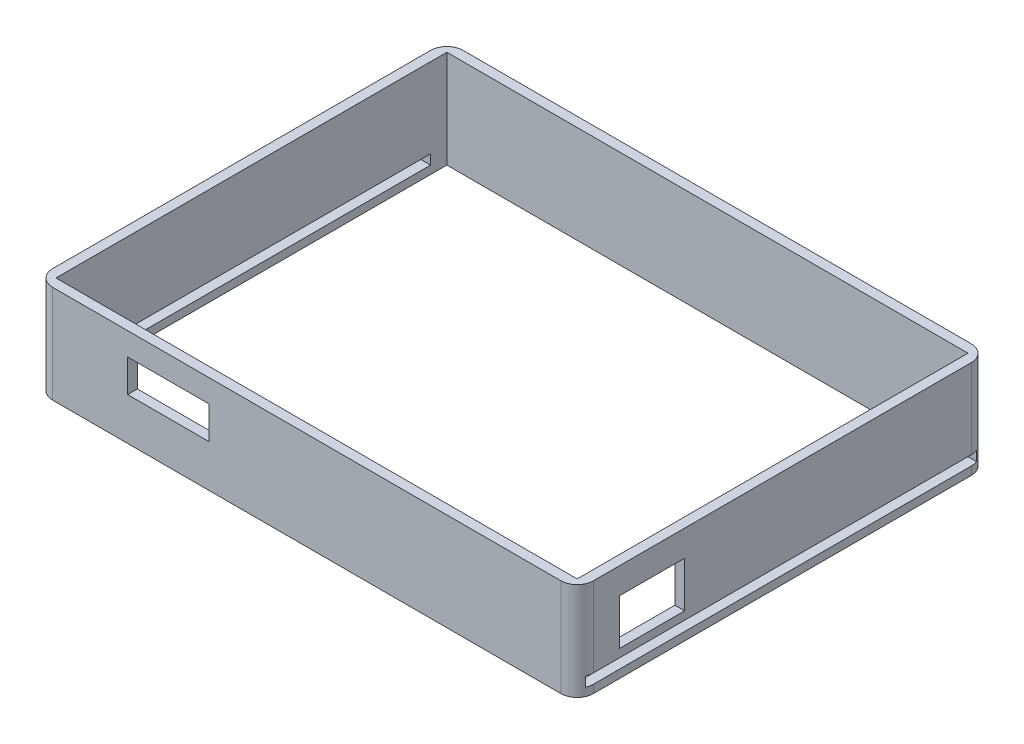
ISO-10303-21;
HEADER;
FILE_DESCRIPTION(('STEP AP214'),'2;1');
FILE_NAME('part.step','',(''),(''),'','','');
FILE_SCHEMA(('AUTOMOTIVE_DESIGN { 1 0 10303 214 1 1 1 1 }'));
ENDSEC;
DATA;
#1=APPLICATION_CONTEXT('core data for automotive mechanical design processes');
#2=APPLICATION_PROTOCOL_DEFINITION('international standard','automotive_design',2000,#1);
#3=PRODUCT_CONTEXT('',#1,'mechanical');
#4=PRODUCT('Part','Part','',(#3));
#5=PRODUCT_RELATED_PRODUCT_CATEGORY('part','',(#4));
#6=PRODUCT_DEFINITION_FORMATION('','',#4);
#7=PRODUCT_DEFINITION_CONTEXT('part definition',#1,'design');
#8=PRODUCT_DEFINITION('design','',#6,#7);
#9=PRODUCT_DEFINITION_SHAPE('','',#8);
#10=(LENGTH_UNIT() NAMED_UNIT(*) SI_UNIT(.MILLI.,.METRE.));
#11=(NAMED_UNIT(*) PLANE_ANGLE_UNIT() SI_UNIT($,.RADIAN.));
#12=(NAMED_UNIT(*) SI_UNIT($,.STERADIAN.) SOLID_ANGLE_UNIT());
#13=UNCERTAINTY_MEASURE_WITH_UNIT(LENGTH_MEASURE(1.E-05),#10,'distance_accuracy_value','');
#14=(GEOMETRIC_REPRESENTATION_CONTEXT(3) GLOBAL_UNCERTAINTY_ASSIGNED_CONTEXT((#13)) GLOBAL_UNIT_ASSIGNED_CONTEXT((#10,
#11,#12)) REPRESENTATION_CONTEXT('',''));
#15=CARTESIAN_POINT('',(0.,0.,0.));
#16=DIRECTION('',(0.,0.,1.));
#17=DIRECTION('',(1.,0.,0.));
#18=AXIS2_PLACEMENT_3D('',#15,#16,#17);
#19=CARTESIAN_POINT('',(82.9999999999999,30.,-63.));
#20=DIRECTION('',(-1.,0.,0.));
#21=DIRECTION('',(0.,0.,1.));
#22=AXIS2_PLACEMENT_3D('',#19,#20,#21);
#23=PLANE('',#22);
#24=DIRECTION('',(0.,1.,0.));
#25=VECTOR('',#24,1.);
#26=CARTESIAN_POINT('',(83.,30.,30.));
#27=LINE('',#26,#25);
#28=CARTESIAN_POINT('',(83.,7.99999999999999,30.));
#29=VERTEX_POINT('',#28);
#30=CARTESIAN_POINT('',(83.,22.,30.));
#31=VERTEX_POINT('',#30);
#32=EDGE_CURVE('E321',#29,#31,#27,.T.);
#33=ORIENTED_EDGE('',*,*,#32,.F.);
#34=DIRECTION('',(0.,0.,-1.));
#35=VECTOR('',#34,1.);
#36=CARTESIAN_POINT('',(82.9999999999999,8.,-63.));
#37=LINE('',#36,#35);
#38=CARTESIAN_POINT('',(83.,7.99999999999999,50.));
#39=VERTEX_POINT('',#38);
#40=EDGE_CURVE('E311',#39,#29,#37,.T.);
#41=ORIENTED_EDGE('',*,*,#40,.F.);
#42=DIRECTION('',(0.,-1.,0.));
#43=VECTOR('',#42,1.);
#44=CARTESIAN_POINT('',(83.,30.,50.));
#45=LINE('',#44,#43);
#46=CARTESIAN_POINT('',(83.,22.,50.));
#47=VERTEX_POINT('',#46);
#48=EDGE_CURVE('E314',#47,#39,#45,.T.);
#49=ORIENTED_EDGE('',*,*,#48,.F.);
#50=DIRECTION('',(0.,0.,1.));
#51=VECTOR('',#50,1.);
#52=CARTESIAN_POINT('',(82.9999999999999,22.,-63.));
#53=LINE('',#52,#51);
#54=EDGE_CURVE('E318',#31,#47,#53,.T.);
#55=ORIENTED_EDGE('',*,*,#54,.F.);
#56=EDGE_LOOP('',(#33,#41,#49,#55));
#57=FACE_BOUND('',#56,.T.);
#58=DIRECTION('',(0.,0.,1.));
#59=VECTOR('',#58,1.);
#60=CARTESIAN_POINT('',(82.9999999999999,5.5,-63.));
#61=LINE('',#60,#59);
#62=CARTESIAN_POINT('',(82.9999999999999,5.5,-58.));
#63=VERTEX_POINT('',#62);
#64=CARTESIAN_POINT('',(83.,5.5,58.));
#65=VERTEX_POINT('',#64);
#66=EDGE_CURVE('E285',#63,#65,#61,.T.);
#67=ORIENTED_EDGE('',*,*,#66,.F.);
#68=DIRECTION('',(0.,-1.,0.));
#69=VECTOR('',#68,1.);
#70=CARTESIAN_POINT('',(82.9999999999999,30.,-58.));
#71=LINE('',#70,#69);
#72=CARTESIAN_POINT('',(82.9999999999999,30.,-58.));
#73=VERTEX_POINT('',#72);
#74=EDGE_CURVE('E479',#63,#73,#71,.F.);
#75=ORIENTED_EDGE('',*,*,#74,.T.);
#76=DIRECTION('',(0.,0.,-1.));
#77=VECTOR('',#76,1.);
#78=CARTESIAN_POINT('',(82.9999999999999,30.,-63.));
#79=LINE('',#78,#77);
#80=CARTESIAN_POINT('',(83.,30.,58.));
#81=VERTEX_POINT('',#80);
#82=EDGE_CURVE('E398',#81,#73,#79,.T.);
#83=ORIENTED_EDGE('',*,*,#82,.F.);
#84=DIRECTION('',(0.,-1.,0.));
#85=VECTOR('',#84,1.);
#86=CARTESIAN_POINT('',(83.,30.,58.));
#87=LINE('',#86,#85);
#88=EDGE_CURVE('E475',#81,#65,#87,.T.);
#89=ORIENTED_EDGE('',*,*,#88,.T.);
#90=EDGE_LOOP('',(#67,#75,#83,#89));
#91=FACE_BOUND('',#90,.T.);
#92=ADVANCED_FACE('F38',(#57,#91),#23,.F.);
#93=DIRECTION('',(0.,0.,-1.));
#94=VECTOR('',#93,1.);
#95=CARTESIAN_POINT('',(82.9999999999999,2.5,-63.));
#96=LINE('',#95,#94);
#97=CARTESIAN_POINT('',(83.,2.5,58.));
#98=VERTEX_POINT('',#97);
#99=CARTESIAN_POINT('',(82.9999999999999,2.5,-58.));
#100=VERTEX_POINT('',#99);
#101=EDGE_CURVE('E274',#98,#100,#96,.T.);
#102=ORIENTED_EDGE('',*,*,#101,.F.);
#103=CARTESIAN_POINT('',(83.,0.,58.));
#104=VERTEX_POINT('',#103);
#105=EDGE_CURVE('E474',#98,#104,#87,.T.);
#106=ORIENTED_EDGE('',*,*,#105,.T.);
#107=DIRECTION('',(0.,0.,-1.));
#108=VECTOR('',#107,1.);
#109=CARTESIAN_POINT('',(82.9999999999999,0.,-63.));
#110=LINE('',#109,#108);
#111=CARTESIAN_POINT('',(82.9999999999999,0.,-58.));
#112=VERTEX_POINT('',#111);
#113=EDGE_CURVE('E397',#104,#112,#110,.T.);
#114=ORIENTED_EDGE('',*,*,#113,.T.);
#115=EDGE_CURVE('E480',#112,#100,#71,.F.);
#116=ORIENTED_EDGE('',*,*,#115,.T.);
#117=EDGE_LOOP('',(#102,#106,#114,#116));
#118=FACE_BOUND('',#117,.T.);
#119=ADVANCED_FACE('F566',(#118),#23,.F.);
#120=CARTESIAN_POINT('',(80.,30.,-60.));
#121=DIRECTION('',(-1.,0.,0.));
#122=DIRECTION('',(0.,0.,1.));
#123=AXIS2_PLACEMENT_3D('',#120,#121,#122);
#124=PLANE('',#123);
#125=DIRECTION('',(0.,0.,-1.));
#126=VECTOR('',#125,1.);
#127=CARTESIAN_POINT('',(80.,8.,-60.));
#128=LINE('',#127,#126);
#129=CARTESIAN_POINT('',(80.,7.99999999999999,50.));
#130=VERTEX_POINT('',#129);
#131=CARTESIAN_POINT('',(80.,8.,30.));
#132=VERTEX_POINT('',#131);
#133=EDGE_CURVE('E500',#130,#132,#128,.T.);
#134=ORIENTED_EDGE('',*,*,#133,.T.);
#135=DIRECTION('',(0.,1.,0.));
#136=VECTOR('',#135,1.);
#137=CARTESIAN_POINT('',(80.,30.,30.));
#138=LINE('',#137,#136);
#139=CARTESIAN_POINT('',(80.,22.,30.));
#140=VERTEX_POINT('',#139);
#141=EDGE_CURVE('E512',#132,#140,#138,.T.);
#142=ORIENTED_EDGE('',*,*,#141,.T.);
#143=DIRECTION('',(0.,0.,1.));
#144=VECTOR('',#143,1.);
#145=CARTESIAN_POINT('',(80.,22.,-60.));
#146=LINE('',#145,#144);
#147=CARTESIAN_POINT('',(80.,22.,50.));
#148=VERTEX_POINT('',#147);
#149=EDGE_CURVE('E508',#140,#148,#146,.T.);
#150=ORIENTED_EDGE('',*,*,#149,.T.);
#151=DIRECTION('',(0.,-1.,0.));
#152=VECTOR('',#151,1.);
#153=CARTESIAN_POINT('',(80.,30.,50.));
#154=LINE('',#153,#152);
#155=EDGE_CURVE('E504',#148,#130,#154,.T.);
#156=ORIENTED_EDGE('',*,*,#155,.T.);
#157=EDGE_LOOP('',(#134,#142,#150,#156));
#158=FACE_BOUND('',#157,.T.);
#159=DIRECTION('',(0.,-1.,0.));
#160=VECTOR('',#159,1.);
#161=CARTESIAN_POINT('',(80.,30.,-60.));
#162=LINE('',#161,#160);
#163=CARTESIAN_POINT('',(80.,30.,-60.));
#164=VERTEX_POINT('',#163);
#165=CARTESIAN_POINT('',(80.,5.5,-60.));
#166=VERTEX_POINT('',#165);
#167=EDGE_CURVE('E393',#164,#166,#162,.T.);
#168=ORIENTED_EDGE('',*,*,#167,.T.);
#169=DIRECTION('',(0.,0.,1.));
#170=VECTOR('',#169,1.);
#171=CARTESIAN_POINT('',(80.,5.5,-60.));
#172=LINE('',#171,#170);
#173=CARTESIAN_POINT('',(80.,5.5,60.));
#174=VERTEX_POINT('',#173);
#175=EDGE_CURVE('E292',#166,#174,#172,.T.);
#176=ORIENTED_EDGE('',*,*,#175,.T.);
#177=DIRECTION('',(0.,-1.,0.));
#178=VECTOR('',#177,1.);
#179=CARTESIAN_POINT('',(80.,30.,60.));
#180=LINE('',#179,#178);
#181=CARTESIAN_POINT('',(80.,30.,60.));
#182=VERTEX_POINT('',#181);
#183=EDGE_CURVE('E382',#182,#174,#180,.T.);
#184=ORIENTED_EDGE('',*,*,#183,.F.);
#185=DIRECTION('',(0.,0.,-1.));
#186=VECTOR('',#185,1.);
#187=CARTESIAN_POINT('',(80.,30.,-60.));
#188=LINE('',#187,#186);
#189=EDGE_CURVE('E353',#182,#164,#188,.T.);
#190=ORIENTED_EDGE('',*,*,#189,.T.);
#191=EDGE_LOOP('',(#168,#176,#184,#190));
#192=FACE_BOUND('',#191,.T.);
#193=ADVANCED_FACE('F572',(#158,#192),#124,.T.);
#194=CARTESIAN_POINT('',(80.,2.5,60.));
#195=VERTEX_POINT('',#194);
#196=CARTESIAN_POINT('',(80.,0.,60.));
#197=VERTEX_POINT('',#196);
#198=EDGE_CURVE('E367',#195,#197,#180,.T.);
#199=ORIENTED_EDGE('',*,*,#198,.F.);
#200=DIRECTION('',(0.,0.,-1.));
#201=VECTOR('',#200,1.);
#202=CARTESIAN_POINT('',(80.,2.5,-60.));
#203=LINE('',#202,#201);
#204=CARTESIAN_POINT('',(80.,2.5,-60.));
#205=VERTEX_POINT('',#204);
#206=EDGE_CURVE('E281',#195,#205,#203,.T.);
#207=ORIENTED_EDGE('',*,*,#206,.T.);
#208=CARTESIAN_POINT('',(80.,0.,-60.));
#209=VERTEX_POINT('',#208);
#210=EDGE_CURVE('E392',#205,#209,#162,.T.);
#211=ORIENTED_EDGE('',*,*,#210,.T.);
#212=DIRECTION('',(0.,0.,-1.));
#213=VECTOR('',#212,1.);
#214=CARTESIAN_POINT('',(80.,0.,-60.));
#215=LINE('',#214,#213);
#216=EDGE_CURVE('E352',#197,#209,#215,.T.);
#217=ORIENTED_EDGE('',*,*,#216,.F.);
#218=EDGE_LOOP('',(#199,#207,#211,#217));
#219=FACE_BOUND('',#218,.T.);
#220=ADVANCED_FACE('F590',(#219),#124,.T.);
#221=CARTESIAN_POINT('',(78.,30.,-58.));
#222=DIRECTION('',(0.,-1.,0.));
#223=DIRECTION('',(0.,0.,-1.));
#224=AXIS2_PLACEMENT_3D('',#221,#222,#223);
#225=CYLINDRICAL_SURFACE('',#224,5.);
#226=ORIENTED_EDGE('',*,*,#74,.F.);
#227=CARTESIAN_POINT('',(78.,5.5,-58.));
#228=DIRECTION('',(0.,-1.,0.));
#229=DIRECTION('',(0.,0.,-1.));
#230=AXIS2_PLACEMENT_3D('',#227,#228,#229);
#231=CIRCLE('',#230,5.);
#232=CARTESIAN_POINT('',(82.5825756949558,5.5,-60.));
#233=VERTEX_POINT('',#232);
#234=EDGE_CURVE('E288',#63,#233,#231,.F.);
#235=ORIENTED_EDGE('',*,*,#234,.T.);
#236=DIRECTION('',(0.,-1.,0.));
#237=VECTOR('',#236,1.);
#238=CARTESIAN_POINT('',(82.5825756949558,30.,-60.));
#239=LINE('',#238,#237);
#240=CARTESIAN_POINT('',(82.5825756949558,2.5,-60.));
#241=VERTEX_POINT('',#240);
#242=EDGE_CURVE('E528',#233,#241,#239,.T.);
#243=ORIENTED_EDGE('',*,*,#242,.T.);
#244=CARTESIAN_POINT('',(78.,2.5,-58.));
#245=DIRECTION('',(0.,1.,0.));
#246=DIRECTION('',(0.,0.,1.));
#247=AXIS2_PLACEMENT_3D('',#244,#245,#246);
#248=CIRCLE('',#247,5.);
#249=EDGE_CURVE('E277',#241,#100,#248,.F.);
#250=ORIENTED_EDGE('',*,*,#249,.T.);
#251=ORIENTED_EDGE('',*,*,#115,.F.);
#252=CARTESIAN_POINT('',(78.,0.,-58.));
#253=DIRECTION('',(0.,1.,0.));
#254=DIRECTION('',(0.,0.,1.));
#255=AXIS2_PLACEMENT_3D('',#252,#253,#254);
#256=CIRCLE('',#255,5.);
#257=CARTESIAN_POINT('',(78.,0.,-63.));
#258=VERTEX_POINT('',#257);
#259=EDGE_CURVE('E439',#258,#112,#256,.F.);
#260=ORIENTED_EDGE('',*,*,#259,.F.);
#261=DIRECTION('',(0.,-1.,0.));
#262=VECTOR('',#261,1.);
#263=CARTESIAN_POINT('',(78.,30.,-63.));
#264=LINE('',#263,#262);
#265=CARTESIAN_POINT('',(78.,30.,-63.));
#266=VERTEX_POINT('',#265);
#267=EDGE_CURVE('E448',#266,#258,#264,.T.);
#268=ORIENTED_EDGE('',*,*,#267,.F.);
#269=CARTESIAN_POINT('',(78.,30.,-58.));
#270=DIRECTION('',(0.,1.,0.));
#271=DIRECTION('',(0.,0.,1.));
#272=AXIS2_PLACEMENT_3D('',#269,#270,#271);
#273=CIRCLE('',#272,5.);
#274=EDGE_CURVE('E458',#73,#266,#273,.T.);
#275=ORIENTED_EDGE('',*,*,#274,.F.);
#276=EDGE_LOOP('',(#226,#235,#243,#250,#251,#260,#268,#275));
#277=FACE_BOUND('',#276,.T.);
#278=ADVANCED_FACE('F588',(#277),#225,.T.);
#279=CARTESIAN_POINT('',(78.,30.,58.));
#280=DIRECTION('',(0.,-1.,0.));
#281=DIRECTION('',(0.,0.,-1.));
#282=AXIS2_PLACEMENT_3D('',#279,#280,#281);
#283=CYLINDRICAL_SURFACE('',#282,5.);
#284=DIRECTION('',(0.,-1.,0.));
#285=VECTOR('',#284,1.);
#286=CARTESIAN_POINT('',(82.5825756949558,30.,60.));
#287=LINE('',#286,#285);
#288=CARTESIAN_POINT('',(82.5825756949558,2.5,60.));
#289=VERTEX_POINT('',#288);
#290=CARTESIAN_POINT('',(82.5825756949558,5.5,60.));
#291=VERTEX_POINT('',#290);
#292=EDGE_CURVE('E520',#289,#291,#287,.F.);
#293=ORIENTED_EDGE('',*,*,#292,.T.);
#294=CARTESIAN_POINT('',(78.,5.5,58.));
#295=DIRECTION('',(0.,-1.,0.));
#296=DIRECTION('',(0.,0.,-1.));
#297=AXIS2_PLACEMENT_3D('',#294,#295,#296);
#298=CIRCLE('',#297,5.);
#299=EDGE_CURVE('E524',#291,#65,#298,.F.);
#300=ORIENTED_EDGE('',*,*,#299,.T.);
#301=ORIENTED_EDGE('',*,*,#88,.F.);
#302=CARTESIAN_POINT('',(78.,30.,58.));
#303=DIRECTION('',(0.,1.,0.));
#304=DIRECTION('',(0.,0.,1.));
#305=AXIS2_PLACEMENT_3D('',#302,#303,#304);
#306=CIRCLE('',#305,5.);
#307=CARTESIAN_POINT('',(78.,30.,63.));
#308=VERTEX_POINT('',#307);
#309=EDGE_CURVE('E455',#308,#81,#306,.T.);
#310=ORIENTED_EDGE('',*,*,#309,.F.);
#311=DIRECTION('',(0.,-1.,0.));
#312=VECTOR('',#311,1.);
#313=CARTESIAN_POINT('',(78.,30.,63.));
#314=LINE('',#313,#312);
#315=CARTESIAN_POINT('',(78.,0.,63.));
#316=VERTEX_POINT('',#315);
#317=EDGE_CURVE('E467',#316,#308,#314,.F.);
#318=ORIENTED_EDGE('',*,*,#317,.F.);
#319=CARTESIAN_POINT('',(78.,0.,58.));
#320=DIRECTION('',(0.,1.,0.));
#321=DIRECTION('',(0.,0.,1.));
#322=AXIS2_PLACEMENT_3D('',#319,#320,#321);
#323=CIRCLE('',#322,5.);
#324=EDGE_CURVE('E436',#104,#316,#323,.F.);
#325=ORIENTED_EDGE('',*,*,#324,.F.);
#326=ORIENTED_EDGE('',*,*,#105,.F.);
#327=CARTESIAN_POINT('',(78.,2.5,58.));
#328=DIRECTION('',(0.,1.,0.));
#329=DIRECTION('',(0.,0.,1.));
#330=AXIS2_PLACEMENT_3D('',#327,#328,#329);
#331=CIRCLE('',#330,5.);
#332=EDGE_CURVE('E516',#98,#289,#331,.F.);
#333=ORIENTED_EDGE('',*,*,#332,.T.);
#334=EDGE_LOOP('',(#293,#300,#301,#310,#318,#325,#326,#333));
#335=FACE_BOUND('',#334,.T.);
#336=ADVANCED_FACE('F40',(#335),#283,.T.);
#337=CARTESIAN_POINT('',(-83.,30.,63.));
#338=DIRECTION('',(0.,0.,-1.));
#339=DIRECTION('',(-1.,0.,0.));
#340=AXIS2_PLACEMENT_3D('',#337,#338,#339);
#341=PLANE('',#340);
#342=DIRECTION('',(1.,0.,0.));
#343=VECTOR('',#342,1.);
#344=CARTESIAN_POINT('',(-83.,30.,63.));
#345=LINE('',#344,#343);
#346=CARTESIAN_POINT('',(-78.,30.,63.));
#347=VERTEX_POINT('',#346);
#348=EDGE_CURVE('E411',#347,#308,#345,.T.);
#349=ORIENTED_EDGE('',*,*,#348,.F.);
#350=DIRECTION('',(0.,-1.,0.));
#351=VECTOR('',#350,1.);
#352=CARTESIAN_POINT('',(-78.,30.,63.));
#353=LINE('',#352,#351);
#354=CARTESIAN_POINT('',(-78.,0.,63.));
#355=VERTEX_POINT('',#354);
#356=EDGE_CURVE('E470',#347,#355,#353,.T.);
#357=ORIENTED_EDGE('',*,*,#356,.T.);
#358=DIRECTION('',(1.,0.,0.));
#359=VECTOR('',#358,1.);
#360=CARTESIAN_POINT('',(-83.,0.,63.));
#361=LINE('',#360,#359);
#362=EDGE_CURVE('E403',#355,#316,#361,.T.);
#363=ORIENTED_EDGE('',*,*,#362,.T.);
#364=ORIENTED_EDGE('',*,*,#317,.T.);
#365=EDGE_LOOP('',(#349,#357,#363,#364));
#366=FACE_BOUND('',#365,.T.);
#367=DIRECTION('',(0.,-1.,0.));
#368=VECTOR('',#367,1.);
#369=CARTESIAN_POINT('',(-55.,30.,63.));
#370=LINE('',#369,#368);
#371=CARTESIAN_POINT('',(-55.,23.,63.));
#372=VERTEX_POINT('',#371);
#373=CARTESIAN_POINT('',(-55.,13.,63.));
#374=VERTEX_POINT('',#373);
#375=EDGE_CURVE('E349',#372,#374,#370,.T.);
#376=ORIENTED_EDGE('',*,*,#375,.F.);
#377=DIRECTION('',(-1.,0.,0.));
#378=VECTOR('',#377,1.);
#379=CARTESIAN_POINT('',(-83.,23.,63.));
#380=LINE('',#379,#378);
#381=CARTESIAN_POINT('',(-30.,23.,63.));
#382=VERTEX_POINT('',#381);
#383=EDGE_CURVE('E339',#382,#372,#380,.T.);
#384=ORIENTED_EDGE('',*,*,#383,.F.);
#385=DIRECTION('',(0.,1.,0.));
#386=VECTOR('',#385,1.);
#387=CARTESIAN_POINT('',(-30.,30.,63.));
#388=LINE('',#387,#386);
#389=CARTESIAN_POINT('',(-30.,13.,63.));
#390=VERTEX_POINT('',#389);
#391=EDGE_CURVE('E342',#390,#382,#388,.T.);
#392=ORIENTED_EDGE('',*,*,#391,.F.);
#393=DIRECTION('',(1.,0.,0.));
#394=VECTOR('',#393,1.);
#395=CARTESIAN_POINT('',(-83.,13.,63.));
#396=LINE('',#395,#394);
#397=EDGE_CURVE('E346',#374,#390,#396,.T.);
#398=ORIENTED_EDGE('',*,*,#397,.F.);
#399=EDGE_LOOP('',(#376,#384,#392,#398));
#400=FACE_BOUND('',#399,.T.);
#401=ADVANCED_FACE('F596',(#366,#400),#341,.F.);
#402=CARTESIAN_POINT('',(-80.,30.,60.));
#403=DIRECTION('',(0.,0.,-1.));
#404=DIRECTION('',(-1.,0.,0.));
#405=AXIS2_PLACEMENT_3D('',#402,#403,#404);
#406=PLANE('',#405);
#407=ORIENTED_EDGE('',*,*,#183,.T.);
#408=DIRECTION('',(-1.,0.,0.));
#409=VECTOR('',#408,1.);
#410=CARTESIAN_POINT('',(100.,5.5,60.));
#411=LINE('',#410,#409);
#412=EDGE_CURVE('E267',#291,#174,#411,.T.);
#413=ORIENTED_EDGE('',*,*,#412,.F.);
#414=ORIENTED_EDGE('',*,*,#292,.F.);
#415=DIRECTION('',(-1.,0.,0.));
#416=VECTOR('',#415,1.);
#417=CARTESIAN_POINT('',(100.,2.5,60.));
#418=LINE('',#417,#416);
#419=EDGE_CURVE('E259',#289,#195,#418,.T.);
#420=ORIENTED_EDGE('',*,*,#419,.T.);
#421=ORIENTED_EDGE('',*,*,#198,.T.);
#422=DIRECTION('',(1.,0.,0.));
#423=VECTOR('',#422,1.);
#424=CARTESIAN_POINT('',(-80.,0.,60.));
#425=LINE('',#424,#423);
#426=CARTESIAN_POINT('',(-80.,0.,60.));
#427=VERTEX_POINT('',#426);
#428=EDGE_CURVE('E357',#427,#197,#425,.T.);
#429=ORIENTED_EDGE('',*,*,#428,.F.);
#430=DIRECTION('',(0.,-1.,0.));
#431=VECTOR('',#430,1.);
#432=CARTESIAN_POINT('',(-80.,30.,60.));
#433=LINE('',#432,#431);
#434=CARTESIAN_POINT('',(-80.,30.,60.));
#435=VERTEX_POINT('',#434);
#436=EDGE_CURVE('E386',#435,#427,#433,.T.);
#437=ORIENTED_EDGE('',*,*,#436,.F.);
#438=DIRECTION('',(1.,0.,0.));
#439=VECTOR('',#438,1.);
#440=CARTESIAN_POINT('',(-80.,30.,60.));
#441=LINE('',#440,#439);
#442=EDGE_CURVE('E364',#435,#182,#441,.T.);
#443=ORIENTED_EDGE('',*,*,#442,.T.);
#444=EDGE_LOOP('',(#407,#413,#414,#420,#421,#429,#437,#443));
#445=FACE_BOUND('',#444,.T.);
#446=DIRECTION('',(-1.,0.,0.));
#447=VECTOR('',#446,1.);
#448=CARTESIAN_POINT('',(-80.,23.,60.));
#449=LINE('',#448,#447);
#450=CARTESIAN_POINT('',(-30.,23.,60.));
#451=VERTEX_POINT('',#450);
#452=CARTESIAN_POINT('',(-55.,23.,60.));
#453=VERTEX_POINT('',#452);
#454=EDGE_CURVE('E484',#451,#453,#449,.T.);
#455=ORIENTED_EDGE('',*,*,#454,.T.);
#456=DIRECTION('',(0.,-1.,0.));
#457=VECTOR('',#456,1.);
#458=CARTESIAN_POINT('',(-55.,30.,60.));
#459=LINE('',#458,#457);
#460=CARTESIAN_POINT('',(-55.,13.,60.));
#461=VERTEX_POINT('',#460);
#462=EDGE_CURVE('E496',#453,#461,#459,.T.);
#463=ORIENTED_EDGE('',*,*,#462,.T.);
#464=DIRECTION('',(1.,0.,0.));
#465=VECTOR('',#464,1.);
#466=CARTESIAN_POINT('',(-80.,13.,60.));
#467=LINE('',#466,#465);
#468=CARTESIAN_POINT('',(-30.,13.,60.));
#469=VERTEX_POINT('',#468);
#470=EDGE_CURVE('E492',#461,#469,#467,.T.);
#471=ORIENTED_EDGE('',*,*,#470,.T.);
#472=DIRECTION('',(0.,1.,0.));
#473=VECTOR('',#472,1.);
#474=CARTESIAN_POINT('',(-30.,30.,60.));
#475=LINE('',#474,#473);
#476=EDGE_CURVE('E488',#469,#451,#475,.T.);
#477=ORIENTED_EDGE('',*,*,#476,.T.);
#478=EDGE_LOOP('',(#455,#463,#471,#477));
#479=FACE_BOUND('',#478,.T.);
#480=ADVANCED_FACE('F613',(#445,#479),#406,.T.);
#481=CARTESIAN_POINT('',(0.,30.,0.));
#482=DIRECTION('',(0.,1.,0.));
#483=DIRECTION('',(0.,0.,1.));
#484=AXIS2_PLACEMENT_3D('',#481,#482,#483);
#485=PLANE('',#484);
#486=DIRECTION('',(-1.,0.,0.));
#487=VECTOR('',#486,1.);
#488=CARTESIAN_POINT('',(-83.0000000000001,30.,-62.9999999999999));
#489=LINE('',#488,#487);
#490=CARTESIAN_POINT('',(-78.0000000000001,30.,-62.9999999999999));
#491=VERTEX_POINT('',#490);
#492=EDGE_CURVE('E402',#266,#491,#489,.T.);
#493=ORIENTED_EDGE('',*,*,#492,.T.);
#494=CARTESIAN_POINT('',(-78.0000000000001,30.,-58.));
#495=DIRECTION('',(0.,1.,0.));
#496=DIRECTION('',(0.,0.,1.));
#497=AXIS2_PLACEMENT_3D('',#494,#495,#496);
#498=CIRCLE('',#497,5.);
#499=CARTESIAN_POINT('',(-83.0000000000001,30.,-58.));
#500=VERTEX_POINT('',#499);
#501=EDGE_CURVE('E464',#491,#500,#498,.T.);
#502=ORIENTED_EDGE('',*,*,#501,.T.);
#503=DIRECTION('',(0.,0.,1.));
#504=VECTOR('',#503,1.);
#505=CARTESIAN_POINT('',(-83.0000000000001,30.,-62.9999999999999));
#506=LINE('',#505,#504);
#507=CARTESIAN_POINT('',(-83.,30.,58.));
#508=VERTEX_POINT('',#507);
#509=EDGE_CURVE('E407',#500,#508,#506,.T.);
#510=ORIENTED_EDGE('',*,*,#509,.T.);
#511=CARTESIAN_POINT('',(-78.,30.,58.));
#512=DIRECTION('',(0.,1.,0.));
#513=DIRECTION('',(0.,0.,1.));
#514=AXIS2_PLACEMENT_3D('',#511,#512,#513);
#515=CIRCLE('',#514,5.);
#516=EDGE_CURVE('E461',#508,#347,#515,.T.);
#517=ORIENTED_EDGE('',*,*,#516,.T.);
#518=ORIENTED_EDGE('',*,*,#348,.T.);
#519=ORIENTED_EDGE('',*,*,#309,.T.);
#520=ORIENTED_EDGE('',*,*,#82,.T.);
#521=ORIENTED_EDGE('',*,*,#274,.T.);
#522=EDGE_LOOP('',(#493,#502,#510,#517,#518,#519,#520,#521));
#523=FACE_BOUND('',#522,.T.);
#524=DIRECTION('',(-1.,0.,0.));
#525=VECTOR('',#524,1.);
#526=CARTESIAN_POINT('',(-80.,30.,-60.));
#527=LINE('',#526,#525);
#528=CARTESIAN_POINT('',(-80.,30.,-60.));
#529=VERTEX_POINT('',#528);
#530=EDGE_CURVE('E356',#164,#529,#527,.T.);
#531=ORIENTED_EDGE('',*,*,#530,.F.);
#532=ORIENTED_EDGE('',*,*,#189,.F.);
#533=ORIENTED_EDGE('',*,*,#442,.F.);
#534=DIRECTION('',(0.,0.,1.));
#535=VECTOR('',#534,1.);
#536=CARTESIAN_POINT('',(-80.,30.,-60.));
#537=LINE('',#536,#535);
#538=EDGE_CURVE('E360',#529,#435,#537,.T.);
#539=ORIENTED_EDGE('',*,*,#538,.F.);
#540=EDGE_LOOP('',(#531,#532,#533,#539));
#541=FACE_BOUND('',#540,.T.);
#542=ADVANCED_FACE('F631',(#523,#541),#485,.T.);
#543=CARTESIAN_POINT('',(0.,0.,0.));
#544=DIRECTION('',(0.,1.,0.));
#545=DIRECTION('',(0.,0.,1.));
#546=AXIS2_PLACEMENT_3D('',#543,#544,#545);
#547=PLANE('',#546);
#548=DIRECTION('',(0.,0.,1.));
#549=VECTOR('',#548,1.);
#550=CARTESIAN_POINT('',(-83.0000000000001,0.,-62.9999999999999));
#551=LINE('',#550,#549);
#552=CARTESIAN_POINT('',(-83.0000000000001,0.,-58.));
#553=VERTEX_POINT('',#552);
#554=CARTESIAN_POINT('',(-83.,0.,58.));
#555=VERTEX_POINT('',#554);
#556=EDGE_CURVE('E423',#553,#555,#551,.T.);
#557=ORIENTED_EDGE('',*,*,#556,.F.);
#558=CARTESIAN_POINT('',(-78.0000000000001,0.,-58.));
#559=DIRECTION('',(0.,1.,0.));
#560=DIRECTION('',(0.,0.,1.));
#561=AXIS2_PLACEMENT_3D('',#558,#559,#560);
#562=CIRCLE('',#561,5.);
#563=CARTESIAN_POINT('',(-78.0000000000001,0.,-62.9999999999999));
#564=VERTEX_POINT('',#563);
#565=EDGE_CURVE('E445',#553,#564,#562,.F.);
#566=ORIENTED_EDGE('',*,*,#565,.T.);
#567=DIRECTION('',(-1.,0.,0.));
#568=VECTOR('',#567,1.);
#569=CARTESIAN_POINT('',(-83.0000000000001,0.,-62.9999999999999));
#570=LINE('',#569,#568);
#571=EDGE_CURVE('E419',#258,#564,#570,.T.);
#572=ORIENTED_EDGE('',*,*,#571,.F.);
#573=ORIENTED_EDGE('',*,*,#259,.T.);
#574=ORIENTED_EDGE('',*,*,#113,.F.);
#575=ORIENTED_EDGE('',*,*,#324,.T.);
#576=ORIENTED_EDGE('',*,*,#362,.F.);
#577=CARTESIAN_POINT('',(-78.,0.,58.));
#578=DIRECTION('',(0.,1.,0.));
#579=DIRECTION('',(0.,0.,1.));
#580=AXIS2_PLACEMENT_3D('',#577,#578,#579);
#581=CIRCLE('',#580,5.);
#582=EDGE_CURVE('E442',#355,#555,#581,.F.);
#583=ORIENTED_EDGE('',*,*,#582,.T.);
#584=EDGE_LOOP('',(#557,#566,#572,#573,#574,#575,#576,#583));
#585=FACE_BOUND('',#584,.T.);
#586=ORIENTED_EDGE('',*,*,#216,.T.);
#587=DIRECTION('',(-1.,0.,0.));
#588=VECTOR('',#587,1.);
#589=CARTESIAN_POINT('',(-80.,0.,-60.));
#590=LINE('',#589,#588);
#591=CARTESIAN_POINT('',(-80.,0.,-60.));
#592=VERTEX_POINT('',#591);
#593=EDGE_CURVE('E371',#209,#592,#590,.T.);
#594=ORIENTED_EDGE('',*,*,#593,.T.);
#595=DIRECTION('',(0.,0.,1.));
#596=VECTOR('',#595,1.);
#597=CARTESIAN_POINT('',(-80.,0.,-60.));
#598=LINE('',#597,#596);
#599=EDGE_CURVE('E375',#592,#427,#598,.T.);
#600=ORIENTED_EDGE('',*,*,#599,.T.);
#601=ORIENTED_EDGE('',*,*,#428,.T.);
#602=EDGE_LOOP('',(#586,#594,#600,#601));
#603=FACE_BOUND('',#602,.T.);
#604=ADVANCED_FACE('F619',(#585,#603),#547,.F.);
#605=CARTESIAN_POINT('',(-83.0000000000001,30.,-62.9999999999999));
#606=DIRECTION('',(0.,0.,1.));
#607=DIRECTION('',(1.,0.,0.));
#608=AXIS2_PLACEMENT_3D('',#605,#606,#607);
#609=PLANE('',#608);
#610=ORIENTED_EDGE('',*,*,#571,.T.);
#611=DIRECTION('',(0.,-1.,0.));
#612=VECTOR('',#611,1.);
#613=CARTESIAN_POINT('',(-78.0000000000001,30.,-62.9999999999999));
#614=LINE('',#613,#612);
#615=EDGE_CURVE('E452',#564,#491,#614,.F.);
#616=ORIENTED_EDGE('',*,*,#615,.T.);
#617=ORIENTED_EDGE('',*,*,#492,.F.);
#618=ORIENTED_EDGE('',*,*,#267,.T.);
#619=EDGE_LOOP('',(#610,#616,#617,#618));
#620=FACE_BOUND('',#619,.T.);
#621=ADVANCED_FACE('F578',(#620),#609,.F.);
#622=CARTESIAN_POINT('',(-83.0000000000001,30.,-62.9999999999999));
#623=DIRECTION('',(1.,0.,0.));
#624=DIRECTION('',(0.,0.,-1.));
#625=AXIS2_PLACEMENT_3D('',#622,#623,#624);
#626=PLANE('',#625);
#627=DIRECTION('',(0.,0.,-1.));
#628=VECTOR('',#627,1.);
#629=CARTESIAN_POINT('',(-83.0000000000001,2.5,-62.9999999999999));
#630=LINE('',#629,#628);
#631=CARTESIAN_POINT('',(-83.,2.5,55.));
#632=VERTEX_POINT('',#631);
#633=CARTESIAN_POINT('',(-83.,2.5,-55.));
#634=VERTEX_POINT('',#633);
#635=EDGE_CURVE('E253',#632,#634,#630,.T.);
#636=ORIENTED_EDGE('',*,*,#635,.T.);
#637=DIRECTION('',(0.,1.,0.));
#638=VECTOR('',#637,1.);
#639=CARTESIAN_POINT('',(-83.0000000000001,30.,-55.));
#640=LINE('',#639,#638);
#641=CARTESIAN_POINT('',(-83.,5.5,-55.));
#642=VERTEX_POINT('',#641);
#643=EDGE_CURVE('E244',#634,#642,#640,.T.);
#644=ORIENTED_EDGE('',*,*,#643,.T.);
#645=DIRECTION('',(0.,0.,1.));
#646=VECTOR('',#645,1.);
#647=CARTESIAN_POINT('',(-83.0000000000001,5.5,-62.9999999999999));
#648=LINE('',#647,#646);
#649=CARTESIAN_POINT('',(-83.,5.5,55.));
#650=VERTEX_POINT('',#649);
#651=EDGE_CURVE('E232',#642,#650,#648,.T.);
#652=ORIENTED_EDGE('',*,*,#651,.T.);
#653=DIRECTION('',(0.,-1.,0.));
#654=VECTOR('',#653,1.);
#655=CARTESIAN_POINT('',(-83.,30.,55.));
#656=LINE('',#655,#654);
#657=EDGE_CURVE('E238',#650,#632,#656,.T.);
#658=ORIENTED_EDGE('',*,*,#657,.T.);
#659=EDGE_LOOP('',(#636,#644,#652,#658));
#660=FACE_BOUND('',#659,.T.);
#661=ORIENTED_EDGE('',*,*,#509,.F.);
#662=DIRECTION('',(0.,-1.,0.));
#663=VECTOR('',#662,1.);
#664=CARTESIAN_POINT('',(-83.0000000000001,30.,-58.));
#665=LINE('',#664,#663);
#666=EDGE_CURVE('E432',#500,#553,#665,.T.);
#667=ORIENTED_EDGE('',*,*,#666,.T.);
#668=ORIENTED_EDGE('',*,*,#556,.T.);
#669=DIRECTION('',(0.,-1.,0.));
#670=VECTOR('',#669,1.);
#671=CARTESIAN_POINT('',(-83.,30.,58.));
#672=LINE('',#671,#670);
#673=EDGE_CURVE('E415',#555,#508,#672,.F.);
#674=ORIENTED_EDGE('',*,*,#673,.T.);
#675=EDGE_LOOP('',(#661,#667,#668,#674));
#676=FACE_BOUND('',#675,.T.);
#677=ADVANCED_FACE('F251',(#660,#676),#626,.F.);
#678=CARTESIAN_POINT('',(-80.,30.,-60.));
#679=DIRECTION('',(0.,0.,1.));
#680=DIRECTION('',(1.,0.,0.));
#681=AXIS2_PLACEMENT_3D('',#678,#679,#680);
#682=PLANE('',#681);
#683=ORIENTED_EDGE('',*,*,#210,.F.);
#684=DIRECTION('',(-1.,0.,0.));
#685=VECTOR('',#684,1.);
#686=CARTESIAN_POINT('',(100.,2.5,-60.));
#687=LINE('',#686,#685);
#688=EDGE_CURVE('E255',#241,#205,#687,.T.);
#689=ORIENTED_EDGE('',*,*,#688,.F.);
#690=ORIENTED_EDGE('',*,*,#242,.F.);
#691=DIRECTION('',(-1.,0.,0.));
#692=VECTOR('',#691,1.);
#693=CARTESIAN_POINT('',(100.,5.5,-60.));
#694=LINE('',#693,#692);
#695=EDGE_CURVE('E270',#233,#166,#694,.T.);
#696=ORIENTED_EDGE('',*,*,#695,.T.);
#697=ORIENTED_EDGE('',*,*,#167,.F.);
#698=ORIENTED_EDGE('',*,*,#530,.T.);
#699=DIRECTION('',(0.,-1.,0.));
#700=VECTOR('',#699,1.);
#701=CARTESIAN_POINT('',(-80.,30.,-60.));
#702=LINE('',#701,#700);
#703=EDGE_CURVE('E389',#529,#592,#702,.T.);
#704=ORIENTED_EDGE('',*,*,#703,.T.);
#705=ORIENTED_EDGE('',*,*,#593,.F.);
#706=EDGE_LOOP('',(#683,#689,#690,#696,#697,#698,#704,#705));
#707=FACE_BOUND('',#706,.T.);
#708=ADVANCED_FACE('F633',(#707),#682,.T.);
#709=CARTESIAN_POINT('',(-80.,30.,-60.));
#710=DIRECTION('',(1.,0.,0.));
#711=DIRECTION('',(0.,0.,-1.));
#712=AXIS2_PLACEMENT_3D('',#709,#710,#711);
#713=PLANE('',#712);
#714=DIRECTION('',(0.,1.,0.));
#715=VECTOR('',#714,1.);
#716=CARTESIAN_POINT('',(-80.,30.,-55.));
#717=LINE('',#716,#715);
#718=CARTESIAN_POINT('',(-80.,2.5,-55.));
#719=VERTEX_POINT('',#718);
#720=CARTESIAN_POINT('',(-80.,5.5,-55.));
#721=VERTEX_POINT('',#720);
#722=EDGE_CURVE('E11',#719,#721,#717,.T.);
#723=ORIENTED_EDGE('',*,*,#722,.F.);
#724=DIRECTION('',(0.,0.,-1.));
#725=VECTOR('',#724,1.);
#726=CARTESIAN_POINT('',(-80.,2.5,-60.));
#727=LINE('',#726,#725);
#728=CARTESIAN_POINT('',(-80.,2.5,55.));
#729=VERTEX_POINT('',#728);
#730=EDGE_CURVE('E47',#729,#719,#727,.T.);
#731=ORIENTED_EDGE('',*,*,#730,.F.);
#732=DIRECTION('',(0.,-1.,0.));
#733=VECTOR('',#732,1.);
#734=CARTESIAN_POINT('',(-80.,30.,55.));
#735=LINE('',#734,#733);
#736=CARTESIAN_POINT('',(-80.,5.5,55.));
#737=VERTEX_POINT('',#736);
#738=EDGE_CURVE('E535',#737,#729,#735,.T.);
#739=ORIENTED_EDGE('',*,*,#738,.F.);
#740=DIRECTION('',(0.,0.,1.));
#741=VECTOR('',#740,1.);
#742=CARTESIAN_POINT('',(-80.,5.5,-60.));
#743=LINE('',#742,#741);
#744=EDGE_CURVE('E532',#721,#737,#743,.T.);
#745=ORIENTED_EDGE('',*,*,#744,.F.);
#746=EDGE_LOOP('',(#723,#731,#739,#745));
#747=FACE_BOUND('',#746,.T.);
#748=ORIENTED_EDGE('',*,*,#599,.F.);
#749=ORIENTED_EDGE('',*,*,#703,.F.);
#750=ORIENTED_EDGE('',*,*,#538,.T.);
#751=ORIENTED_EDGE('',*,*,#436,.T.);
#752=EDGE_LOOP('',(#748,#749,#750,#751));
#753=FACE_BOUND('',#752,.T.);
#754=ADVANCED_FACE('F548',(#747,#753),#713,.T.);
#755=CARTESIAN_POINT('',(-78.0000000000001,30.,-58.));
#756=DIRECTION('',(0.,-1.,0.));
#757=DIRECTION('',(0.,0.,-1.));
#758=AXIS2_PLACEMENT_3D('',#755,#756,#757);
#759=CYLINDRICAL_SURFACE('',#758,5.);
#760=ORIENTED_EDGE('',*,*,#501,.F.);
#761=ORIENTED_EDGE('',*,*,#615,.F.);
#762=ORIENTED_EDGE('',*,*,#565,.F.);
#763=ORIENTED_EDGE('',*,*,#666,.F.);
#764=EDGE_LOOP('',(#760,#761,#762,#763));
#765=FACE_BOUND('',#764,.T.);
#766=ADVANCED_FACE('F580',(#765),#759,.T.);
#767=CARTESIAN_POINT('',(-78.,30.,58.));
#768=DIRECTION('',(0.,-1.,0.));
#769=DIRECTION('',(0.,0.,-1.));
#770=AXIS2_PLACEMENT_3D('',#767,#768,#769);
#771=CYLINDRICAL_SURFACE('',#770,5.);
#772=ORIENTED_EDGE('',*,*,#516,.F.);
#773=ORIENTED_EDGE('',*,*,#673,.F.);
#774=ORIENTED_EDGE('',*,*,#582,.F.);
#775=ORIENTED_EDGE('',*,*,#356,.F.);
#776=EDGE_LOOP('',(#772,#773,#774,#775));
#777=FACE_BOUND('',#776,.T.);
#778=ADVANCED_FACE('F583',(#777),#771,.T.);
#779=CARTESIAN_POINT('',(-55.,23.,100.));
#780=DIRECTION('',(1.,0.,0.));
#781=DIRECTION('',(0.,0.,-1.));
#782=AXIS2_PLACEMENT_3D('',#779,#780,#781);
#783=PLANE('',#782);
#784=ORIENTED_EDGE('',*,*,#375,.T.);
#785=DIRECTION('',(0.,0.,-1.));
#786=VECTOR('',#785,1.);
#787=CARTESIAN_POINT('',(-55.,13.,100.));
#788=LINE('',#787,#786);
#789=EDGE_CURVE('E335',#374,#461,#788,.T.);
#790=ORIENTED_EDGE('',*,*,#789,.T.);
#791=ORIENTED_EDGE('',*,*,#462,.F.);
#792=DIRECTION('',(0.,0.,-1.));
#793=VECTOR('',#792,1.);
#794=CARTESIAN_POINT('',(-55.,23.,100.));
#795=LINE('',#794,#793);
#796=EDGE_CURVE('E324',#372,#453,#795,.T.);
#797=ORIENTED_EDGE('',*,*,#796,.F.);
#798=EDGE_LOOP('',(#784,#790,#791,#797));
#799=FACE_BOUND('',#798,.T.);
#800=ADVANCED_FACE('F586',(#799),#783,.T.);
#801=CARTESIAN_POINT('',(-55.,13.,100.));
#802=DIRECTION('',(0.,1.,0.));
#803=DIRECTION('',(0.,0.,1.));
#804=AXIS2_PLACEMENT_3D('',#801,#802,#803);
#805=PLANE('',#804);
#806=ORIENTED_EDGE('',*,*,#397,.T.);
#807=DIRECTION('',(0.,0.,-1.));
#808=VECTOR('',#807,1.);
#809=CARTESIAN_POINT('',(-30.,13.,100.));
#810=LINE('',#809,#808);
#811=EDGE_CURVE('E331',#390,#469,#810,.T.);
#812=ORIENTED_EDGE('',*,*,#811,.T.);
#813=ORIENTED_EDGE('',*,*,#470,.F.);
#814=ORIENTED_EDGE('',*,*,#789,.F.);
#815=EDGE_LOOP('',(#806,#812,#813,#814));
#816=FACE_BOUND('',#815,.T.);
#817=ADVANCED_FACE('F676',(#816),#805,.T.);
#818=CARTESIAN_POINT('',(-30.,23.,100.));
#819=DIRECTION('',(-1.,0.,0.));
#820=DIRECTION('',(0.,-1.,0.));
#821=AXIS2_PLACEMENT_3D('',#818,#819,#820);
#822=PLANE('',#821);
#823=ORIENTED_EDGE('',*,*,#391,.T.);
#824=DIRECTION('',(0.,0.,-1.));
#825=VECTOR('',#824,1.);
#826=CARTESIAN_POINT('',(-30.,23.,100.));
#827=LINE('',#826,#825);
#828=EDGE_CURVE('E327',#382,#451,#827,.T.);
#829=ORIENTED_EDGE('',*,*,#828,.T.);
#830=ORIENTED_EDGE('',*,*,#476,.F.);
#831=ORIENTED_EDGE('',*,*,#811,.F.);
#832=EDGE_LOOP('',(#823,#829,#830,#831));
#833=FACE_BOUND('',#832,.T.);
#834=ADVANCED_FACE('F681',(#833),#822,.T.);
#835=CARTESIAN_POINT('',(-55.,23.,100.));
#836=DIRECTION('',(0.,-1.,0.));
#837=DIRECTION('',(0.,0.,-1.));
#838=AXIS2_PLACEMENT_3D('',#835,#836,#837);
#839=PLANE('',#838);
#840=ORIENTED_EDGE('',*,*,#383,.T.);
#841=ORIENTED_EDGE('',*,*,#796,.T.);
#842=ORIENTED_EDGE('',*,*,#454,.F.);
#843=ORIENTED_EDGE('',*,*,#828,.F.);
#844=EDGE_LOOP('',(#840,#841,#842,#843));
#845=FACE_BOUND('',#844,.T.);
#846=ADVANCED_FACE('F679',(#845),#839,.T.);
#847=CARTESIAN_POINT('',(100.,22.,30.));
#848=DIRECTION('',(0.,0.,1.));
#849=DIRECTION('',(1.,0.,0.));
#850=AXIS2_PLACEMENT_3D('',#847,#848,#849);
#851=PLANE('',#850);
#852=ORIENTED_EDGE('',*,*,#32,.T.);
#853=DIRECTION('',(-1.,0.,0.));
#854=VECTOR('',#853,1.);
#855=CARTESIAN_POINT('',(100.,22.,30.));
#856=LINE('',#855,#854);
#857=EDGE_CURVE('E307',#31,#140,#856,.T.);
#858=ORIENTED_EDGE('',*,*,#857,.T.);
#859=ORIENTED_EDGE('',*,*,#141,.F.);
#860=DIRECTION('',(-1.,0.,0.));
#861=VECTOR('',#860,1.);
#862=CARTESIAN_POINT('',(100.,7.99999999999999,30.));
#863=LINE('',#862,#861);
#864=EDGE_CURVE('E296',#29,#132,#863,.T.);
#865=ORIENTED_EDGE('',*,*,#864,.F.);
#866=EDGE_LOOP('',(#852,#858,#859,#865));
#867=FACE_BOUND('',#866,.T.);
#868=ADVANCED_FACE('F688',(#867),#851,.T.);
#869=CARTESIAN_POINT('',(100.,22.,50.));
#870=DIRECTION('',(0.,-1.,0.));
#871=DIRECTION('',(0.,0.,-1.));
#872=AXIS2_PLACEMENT_3D('',#869,#870,#871);
#873=PLANE('',#872);
#874=ORIENTED_EDGE('',*,*,#54,.T.);
#875=DIRECTION('',(-1.,0.,0.));
#876=VECTOR('',#875,1.);
#877=CARTESIAN_POINT('',(100.,22.,50.));
#878=LINE('',#877,#876);
#879=EDGE_CURVE('E303',#47,#148,#878,.T.);
#880=ORIENTED_EDGE('',*,*,#879,.T.);
#881=ORIENTED_EDGE('',*,*,#149,.F.);
#882=ORIENTED_EDGE('',*,*,#857,.F.);
#883=EDGE_LOOP('',(#874,#880,#881,#882));
#884=FACE_BOUND('',#883,.T.);
#885=ADVANCED_FACE('F783',(#884),#873,.T.);
#886=CARTESIAN_POINT('',(100.,22.,50.));
#887=DIRECTION('',(0.,0.,-1.));
#888=DIRECTION('',(-1.,0.,0.));
#889=AXIS2_PLACEMENT_3D('',#886,#887,#888);
#890=PLANE('',#889);
#891=ORIENTED_EDGE('',*,*,#48,.T.);
#892=DIRECTION('',(-1.,0.,0.));
#893=VECTOR('',#892,1.);
#894=CARTESIAN_POINT('',(100.,7.99999999999999,50.));
#895=LINE('',#894,#893);
#896=EDGE_CURVE('E299',#39,#130,#895,.T.);
#897=ORIENTED_EDGE('',*,*,#896,.T.);
#898=ORIENTED_EDGE('',*,*,#155,.F.);
#899=ORIENTED_EDGE('',*,*,#879,.F.);
#900=EDGE_LOOP('',(#891,#897,#898,#899));
#901=FACE_BOUND('',#900,.T.);
#902=ADVANCED_FACE('F772',(#901),#890,.T.);
#903=CARTESIAN_POINT('',(100.,7.99999999999999,50.));
#904=DIRECTION('',(0.,1.,0.));
#905=DIRECTION('',(0.,0.,1.));
#906=AXIS2_PLACEMENT_3D('',#903,#904,#905);
#907=PLANE('',#906);
#908=ORIENTED_EDGE('',*,*,#40,.T.);
#909=ORIENTED_EDGE('',*,*,#864,.T.);
#910=ORIENTED_EDGE('',*,*,#133,.F.);
#911=ORIENTED_EDGE('',*,*,#896,.F.);
#912=EDGE_LOOP('',(#908,#909,#910,#911));
#913=FACE_BOUND('',#912,.T.);
#914=ADVANCED_FACE('F768',(#913),#907,.T.);
#915=CARTESIAN_POINT('',(100.,5.5,60.));
#916=DIRECTION('',(0.,-1.,0.));
#917=DIRECTION('',(0.,0.,-1.));
#918=AXIS2_PLACEMENT_3D('',#915,#916,#917);
#919=PLANE('',#918);
#920=ORIENTED_EDGE('',*,*,#695,.F.);
#921=ORIENTED_EDGE('',*,*,#234,.F.);
#922=ORIENTED_EDGE('',*,*,#66,.T.);
#923=ORIENTED_EDGE('',*,*,#299,.F.);
#924=ORIENTED_EDGE('',*,*,#412,.T.);
#925=ORIENTED_EDGE('',*,*,#175,.F.);
#926=EDGE_LOOP('',(#920,#921,#922,#923,#924,#925));
#927=FACE_BOUND('',#926,.T.);
#928=ADVANCED_FACE('F637',(#927),#919,.T.);
#929=CARTESIAN_POINT('',(100.,2.5,60.));
#930=DIRECTION('',(0.,1.,0.));
#931=DIRECTION('',(0.,0.,1.));
#932=AXIS2_PLACEMENT_3D('',#929,#930,#931);
#933=PLANE('',#932);
#934=ORIENTED_EDGE('',*,*,#419,.F.);
#935=ORIENTED_EDGE('',*,*,#332,.F.);
#936=ORIENTED_EDGE('',*,*,#101,.T.);
#937=ORIENTED_EDGE('',*,*,#249,.F.);
#938=ORIENTED_EDGE('',*,*,#688,.T.);
#939=ORIENTED_EDGE('',*,*,#206,.F.);
#940=EDGE_LOOP('',(#934,#935,#936,#937,#938,#939));
#941=FACE_BOUND('',#940,.T.);
#942=ADVANCED_FACE('F643',(#941),#933,.T.);
#943=CARTESIAN_POINT('',(-100.,5.5,-55.));
#944=DIRECTION('',(0.,0.,-1.));
#945=DIRECTION('',(-1.,0.,0.));
#946=AXIS2_PLACEMENT_3D('',#943,#944,#945);
#947=PLANE('',#946);
#948=DIRECTION('',(1.,0.,0.));
#949=VECTOR('',#948,1.);
#950=CARTESIAN_POINT('',(-100.,2.5,-55.));
#951=LINE('',#950,#949);
#952=EDGE_CURVE('E239',#634,#719,#951,.T.);
#953=ORIENTED_EDGE('',*,*,#952,.T.);
#954=ORIENTED_EDGE('',*,*,#722,.T.);
#955=DIRECTION('',(1.,0.,0.));
#956=VECTOR('',#955,1.);
#957=CARTESIAN_POINT('',(-100.,5.5,-55.));
#958=LINE('',#957,#956);
#959=EDGE_CURVE('E59',#642,#721,#958,.T.);
#960=ORIENTED_EDGE('',*,*,#959,.F.);
#961=ORIENTED_EDGE('',*,*,#643,.F.);
#962=EDGE_LOOP('',(#953,#954,#960,#961));
#963=FACE_BOUND('',#962,.T.);
#964=ADVANCED_FACE('F243',(#963),#947,.F.);
#965=CARTESIAN_POINT('',(-100.,2.5,55.));
#966=DIRECTION('',(0.,-1.,0.));
#967=DIRECTION('',(0.,0.,-1.));
#968=AXIS2_PLACEMENT_3D('',#965,#966,#967);
#969=PLANE('',#968);
#970=DIRECTION('',(1.,0.,0.));
#971=VECTOR('',#970,1.);
#972=CARTESIAN_POINT('',(-100.,2.5,55.));
#973=LINE('',#972,#971);
#974=EDGE_CURVE('E543',#632,#729,#973,.T.);
#975=ORIENTED_EDGE('',*,*,#974,.T.);
#976=ORIENTED_EDGE('',*,*,#730,.T.);
#977=ORIENTED_EDGE('',*,*,#952,.F.);
#978=ORIENTED_EDGE('',*,*,#635,.F.);
#979=EDGE_LOOP('',(#975,#976,#977,#978));
#980=FACE_BOUND('',#979,.T.);
#981=ADVANCED_FACE('F541',(#980),#969,.F.);
#982=CARTESIAN_POINT('',(-100.,5.5,55.));
#983=DIRECTION('',(0.,0.,1.));
#984=DIRECTION('',(1.,0.,0.));
#985=AXIS2_PLACEMENT_3D('',#982,#983,#984);
#986=PLANE('',#985);
#987=DIRECTION('',(1.,0.,0.));
#988=VECTOR('',#987,1.);
#989=CARTESIAN_POINT('',(-100.,5.5,55.));
#990=LINE('',#989,#988);
#991=EDGE_CURVE('E54',#650,#737,#990,.T.);
#992=ORIENTED_EDGE('',*,*,#991,.T.);
#993=ORIENTED_EDGE('',*,*,#738,.T.);
#994=ORIENTED_EDGE('',*,*,#974,.F.);
#995=ORIENTED_EDGE('',*,*,#657,.F.);
#996=EDGE_LOOP('',(#992,#993,#994,#995));
#997=FACE_BOUND('',#996,.T.);
#998=ADVANCED_FACE('F551',(#997),#986,.F.);
#999=CARTESIAN_POINT('',(-100.,5.5,55.));
#1000=DIRECTION('',(0.,1.,0.));
#1001=DIRECTION('',(0.,0.,1.));
#1002=AXIS2_PLACEMENT_3D('',#999,#1000,#1001);
#1003=PLANE('',#1002);
#1004=ORIENTED_EDGE('',*,*,#959,.T.);
#1005=ORIENTED_EDGE('',*,*,#744,.T.);
#1006=ORIENTED_EDGE('',*,*,#991,.F.);
#1007=ORIENTED_EDGE('',*,*,#651,.F.);
#1008=EDGE_LOOP('',(#1004,#1005,#1006,#1007));
#1009=FACE_BOUND('',#1008,.T.);
#1010=ADVANCED_FACE('F233',(#1009),#1003,.F.);
#1011=CLOSED_SHELL('',(#92,#119,#193,#220,#278,#336,#401,#480,#542,#604,#621,#677,#708,#754,
#766,#778,#800,#817,#834,#846,#868,#885,#902,#914,#928,#942,#964,#981,#998,#1010));
#1012=MANIFOLD_SOLID_BREP('B2',#1011);
#1013=ADVANCED_BREP_SHAPE_REPRESENTATION('',(#18,#1012),#14);
#1014=SHAPE_DEFINITION_REPRESENTATION(#9,#1013);
ENDSEC;
END-ISO-10303-21;
